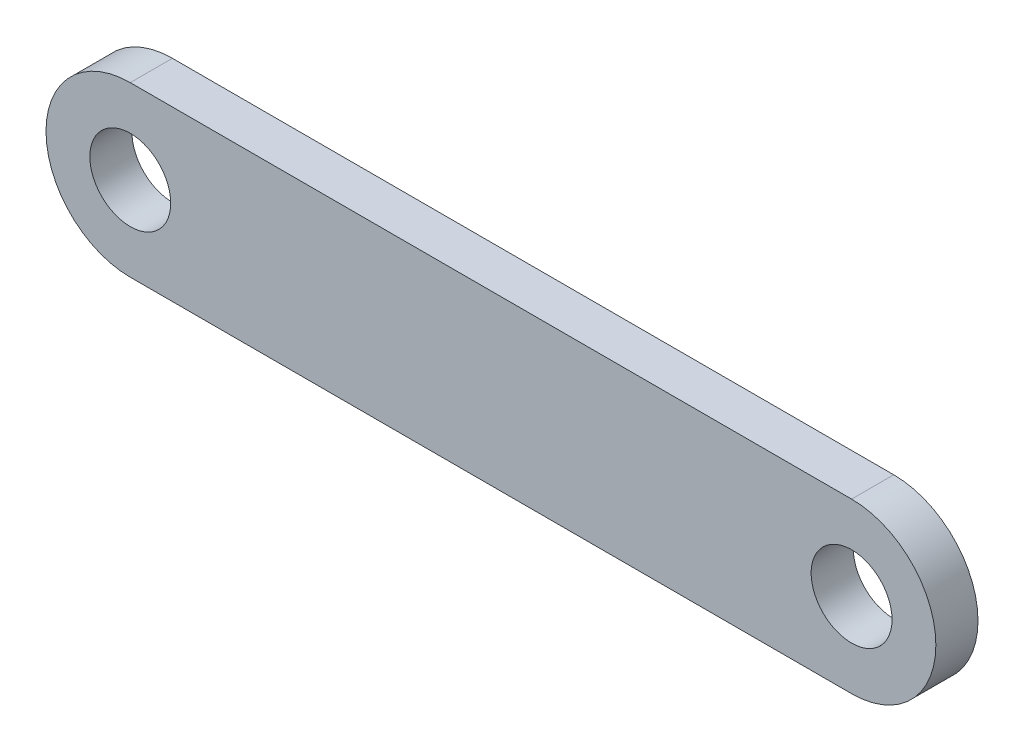
ISO-10303-21;
HEADER;
FILE_DESCRIPTION(('STEP AP214'),'2;1');
FILE_NAME('part.step','',(''),(''),'','','');
FILE_SCHEMA(('AUTOMOTIVE_DESIGN { 1 0 10303 214 1 1 1 1 }'));
ENDSEC;
DATA;
#1=APPLICATION_CONTEXT('core data for automotive mechanical design processes');
#2=APPLICATION_PROTOCOL_DEFINITION('international standard','automotive_design',2000,#1);
#3=PRODUCT_CONTEXT('',#1,'mechanical');
#4=PRODUCT('Part','Part','',(#3));
#5=PRODUCT_RELATED_PRODUCT_CATEGORY('part','',(#4));
#6=PRODUCT_DEFINITION_FORMATION('','',#4);
#7=PRODUCT_DEFINITION_CONTEXT('part definition',#1,'design');
#8=PRODUCT_DEFINITION('design','',#6,#7);
#9=PRODUCT_DEFINITION_SHAPE('','',#8);
#10=(LENGTH_UNIT() NAMED_UNIT(*) SI_UNIT(.MILLI.,.METRE.));
#11=(NAMED_UNIT(*) PLANE_ANGLE_UNIT() SI_UNIT($,.RADIAN.));
#12=(NAMED_UNIT(*) SI_UNIT($,.STERADIAN.) SOLID_ANGLE_UNIT());
#13=UNCERTAINTY_MEASURE_WITH_UNIT(LENGTH_MEASURE(1.E-05),#10,'distance_accuracy_value','');
#14=(GEOMETRIC_REPRESENTATION_CONTEXT(3) GLOBAL_UNCERTAINTY_ASSIGNED_CONTEXT((#13)) GLOBAL_UNIT_ASSIGNED_CONTEXT((#10,
#11,#12)) REPRESENTATION_CONTEXT('',''));
#15=CARTESIAN_POINT('',(0.,0.,0.));
#16=DIRECTION('',(0.,0.,1.));
#17=DIRECTION('',(1.,0.,0.));
#18=AXIS2_PLACEMENT_3D('',#15,#16,#17);
#19=CARTESIAN_POINT('',(27.178,0.,3.175));
#20=DIRECTION('',(0.,0.,1.));
#21=DIRECTION('',(1.,0.,0.));
#22=AXIS2_PLACEMENT_3D('',#19,#20,#21);
#23=PLANE('',#22);
#24=CARTESIAN_POINT('',(27.178,0.,3.175));
#25=DIRECTION('',(0.,0.,1.));
#26=DIRECTION('',(1.,0.,0.));
#27=AXIS2_PLACEMENT_3D('',#24,#25,#26);
#28=CIRCLE('',#27,3.048);
#29=CARTESIAN_POINT('',(30.226,0.,3.175));
#30=VERTEX_POINT('',#29);
#31=EDGE_CURVE('E112',#30,#30,#28,.T.);
#32=ORIENTED_EDGE('',*,*,#31,.F.);
#33=EDGE_LOOP('',(#32));
#34=FACE_BOUND('',#33,.T.);
#35=CARTESIAN_POINT('',(27.178,0.,3.175));
#36=DIRECTION('',(0.,0.,1.));
#37=DIRECTION('',(1.,0.,0.));
#38=AXIS2_PLACEMENT_3D('',#35,#36,#37);
#39=CIRCLE('',#38,6.35);
#40=CARTESIAN_POINT('',(27.178,-6.35,3.175));
#41=VERTEX_POINT('',#40);
#42=CARTESIAN_POINT('',(27.178,6.35,3.175));
#43=VERTEX_POINT('',#42);
#44=EDGE_CURVE('E92',#41,#43,#39,.T.);
#45=ORIENTED_EDGE('',*,*,#44,.T.);
#46=DIRECTION('',(-1.,0.,0.));
#47=VECTOR('',#46,1.);
#48=CARTESIAN_POINT('',(-27.178,6.35,3.175));
#49=LINE('',#48,#47);
#50=CARTESIAN_POINT('',(-27.178,6.35,3.175));
#51=VERTEX_POINT('',#50);
#52=EDGE_CURVE('E87',#43,#51,#49,.T.);
#53=ORIENTED_EDGE('',*,*,#52,.T.);
#54=CARTESIAN_POINT('',(-27.178,0.,3.175));
#55=DIRECTION('',(0.,0.,1.));
#56=DIRECTION('',(1.,0.,0.));
#57=AXIS2_PLACEMENT_3D('',#54,#55,#56);
#58=CIRCLE('',#57,6.35);
#59=CARTESIAN_POINT('',(-27.178,-6.35,3.175));
#60=VERTEX_POINT('',#59);
#61=EDGE_CURVE('E90',#51,#60,#58,.T.);
#62=ORIENTED_EDGE('',*,*,#61,.T.);
#63=DIRECTION('',(1.,0.,0.));
#64=VECTOR('',#63,1.);
#65=CARTESIAN_POINT('',(-27.178,-6.35,3.175));
#66=LINE('',#65,#64);
#67=EDGE_CURVE('E57',#60,#41,#66,.T.);
#68=ORIENTED_EDGE('',*,*,#67,.T.);
#69=EDGE_LOOP('',(#45,#53,#62,#68));
#70=FACE_BOUND('',#69,.T.);
#71=CARTESIAN_POINT('',(-27.178,0.,3.175));
#72=DIRECTION('',(0.,0.,1.));
#73=DIRECTION('',(1.,0.,0.));
#74=AXIS2_PLACEMENT_3D('',#71,#72,#73);
#75=CIRCLE('',#74,3.048);
#76=CARTESIAN_POINT('',(-24.13,0.,3.175));
#77=VERTEX_POINT('',#76);
#78=EDGE_CURVE('E134',#77,#77,#75,.T.);
#79=ORIENTED_EDGE('',*,*,#78,.F.);
#80=EDGE_LOOP('',(#79));
#81=FACE_BOUND('',#80,.T.);
#82=ADVANCED_FACE('F39',(#34,#70,#81),#23,.T.);
#83=CARTESIAN_POINT('',(27.178,0.,0.));
#84=DIRECTION('',(0.,0.,1.));
#85=DIRECTION('',(1.,0.,0.));
#86=AXIS2_PLACEMENT_3D('',#83,#84,#85);
#87=PLANE('',#86);
#88=CARTESIAN_POINT('',(27.178,0.,0.));
#89=DIRECTION('',(0.,0.,1.));
#90=DIRECTION('',(1.,0.,0.));
#91=AXIS2_PLACEMENT_3D('',#88,#89,#90);
#92=CIRCLE('',#91,6.35);
#93=CARTESIAN_POINT('',(27.178,-6.35,0.));
#94=VERTEX_POINT('',#93);
#95=CARTESIAN_POINT('',(27.178,6.35,0.));
#96=VERTEX_POINT('',#95);
#97=EDGE_CURVE('E108',#94,#96,#92,.T.);
#98=ORIENTED_EDGE('',*,*,#97,.F.);
#99=DIRECTION('',(1.,0.,0.));
#100=VECTOR('',#99,1.);
#101=CARTESIAN_POINT('',(-27.178,-6.35,0.));
#102=LINE('',#101,#100);
#103=CARTESIAN_POINT('',(-27.178,-6.35,0.));
#104=VERTEX_POINT('',#103);
#105=EDGE_CURVE('E80',#104,#94,#102,.T.);
#106=ORIENTED_EDGE('',*,*,#105,.F.);
#107=CARTESIAN_POINT('',(-27.178,0.,0.));
#108=DIRECTION('',(0.,0.,1.));
#109=DIRECTION('',(1.,0.,0.));
#110=AXIS2_PLACEMENT_3D('',#107,#108,#109);
#111=CIRCLE('',#110,6.35);
#112=CARTESIAN_POINT('',(-27.178,6.35,0.));
#113=VERTEX_POINT('',#112);
#114=EDGE_CURVE('E74',#113,#104,#111,.T.);
#115=ORIENTED_EDGE('',*,*,#114,.F.);
#116=DIRECTION('',(-1.,0.,0.));
#117=VECTOR('',#116,1.);
#118=CARTESIAN_POINT('',(-27.178,6.35,0.));
#119=LINE('',#118,#117);
#120=EDGE_CURVE('E97',#96,#113,#119,.T.);
#121=ORIENTED_EDGE('',*,*,#120,.F.);
#122=EDGE_LOOP('',(#98,#106,#115,#121));
#123=FACE_BOUND('',#122,.T.);
#124=CARTESIAN_POINT('',(27.178,0.,0.));
#125=DIRECTION('',(0.,0.,1.));
#126=DIRECTION('',(1.,0.,0.));
#127=AXIS2_PLACEMENT_3D('',#124,#125,#126);
#128=CIRCLE('',#127,3.048);
#129=CARTESIAN_POINT('',(30.226,0.,0.));
#130=VERTEX_POINT('',#129);
#131=EDGE_CURVE('E130',#130,#130,#128,.T.);
#132=ORIENTED_EDGE('',*,*,#131,.T.);
#133=EDGE_LOOP('',(#132));
#134=FACE_BOUND('',#133,.T.);
#135=CARTESIAN_POINT('',(-27.178,0.,0.));
#136=DIRECTION('',(0.,0.,1.));
#137=DIRECTION('',(1.,0.,0.));
#138=AXIS2_PLACEMENT_3D('',#135,#136,#137);
#139=CIRCLE('',#138,3.048);
#140=CARTESIAN_POINT('',(-24.13,0.,0.));
#141=VERTEX_POINT('',#140);
#142=EDGE_CURVE('E138',#141,#141,#139,.T.);
#143=ORIENTED_EDGE('',*,*,#142,.T.);
#144=EDGE_LOOP('',(#143));
#145=FACE_BOUND('',#144,.T.);
#146=ADVANCED_FACE('F125',(#123,#134,#145),#87,.F.);
#147=CARTESIAN_POINT('',(27.178,0.,3.175));
#148=DIRECTION('',(0.,0.,-1.));
#149=DIRECTION('',(-1.,0.,0.));
#150=AXIS2_PLACEMENT_3D('',#147,#148,#149);
#151=CYLINDRICAL_SURFACE('',#150,6.35);
#152=ORIENTED_EDGE('',*,*,#97,.T.);
#153=DIRECTION('',(0.,0.,-1.));
#154=VECTOR('',#153,1.);
#155=CARTESIAN_POINT('',(27.178,6.35,3.175));
#156=LINE('',#155,#154);
#157=EDGE_CURVE('E11',#43,#96,#156,.T.);
#158=ORIENTED_EDGE('',*,*,#157,.F.);
#159=ORIENTED_EDGE('',*,*,#44,.F.);
#160=DIRECTION('',(0.,0.,-1.));
#161=VECTOR('',#160,1.);
#162=CARTESIAN_POINT('',(27.178,-6.35,3.175));
#163=LINE('',#162,#161);
#164=EDGE_CURVE('E104',#41,#94,#163,.T.);
#165=ORIENTED_EDGE('',*,*,#164,.T.);
#166=EDGE_LOOP('',(#152,#158,#159,#165));
#167=FACE_BOUND('',#166,.T.);
#168=ADVANCED_FACE('F41',(#167),#151,.T.);
#169=CARTESIAN_POINT('',(-27.178,6.35,3.175));
#170=DIRECTION('',(0.,-1.,0.));
#171=DIRECTION('',(0.,0.,-1.));
#172=AXIS2_PLACEMENT_3D('',#169,#170,#171);
#173=PLANE('',#172);
#174=ORIENTED_EDGE('',*,*,#120,.T.);
#175=DIRECTION('',(0.,0.,-1.));
#176=VECTOR('',#175,1.);
#177=CARTESIAN_POINT('',(-27.178,6.35,3.175));
#178=LINE('',#177,#176);
#179=EDGE_CURVE('E49',#51,#113,#178,.T.);
#180=ORIENTED_EDGE('',*,*,#179,.F.);
#181=ORIENTED_EDGE('',*,*,#52,.F.);
#182=ORIENTED_EDGE('',*,*,#157,.T.);
#183=EDGE_LOOP('',(#174,#180,#181,#182));
#184=FACE_BOUND('',#183,.T.);
#185=ADVANCED_FACE('F96',(#184),#173,.F.);
#186=CARTESIAN_POINT('',(-27.178,0.,3.175));
#187=DIRECTION('',(0.,0.,-1.));
#188=DIRECTION('',(-1.,0.,0.));
#189=AXIS2_PLACEMENT_3D('',#186,#187,#188);
#190=CYLINDRICAL_SURFACE('',#189,6.35);
#191=ORIENTED_EDGE('',*,*,#114,.T.);
#192=DIRECTION('',(0.,0.,-1.));
#193=VECTOR('',#192,1.);
#194=CARTESIAN_POINT('',(-27.178,-6.35,3.175));
#195=LINE('',#194,#193);
#196=EDGE_CURVE('E99',#60,#104,#195,.T.);
#197=ORIENTED_EDGE('',*,*,#196,.F.);
#198=ORIENTED_EDGE('',*,*,#61,.F.);
#199=ORIENTED_EDGE('',*,*,#179,.T.);
#200=EDGE_LOOP('',(#191,#197,#198,#199));
#201=FACE_BOUND('',#200,.T.);
#202=ADVANCED_FACE('F100',(#201),#190,.T.);
#203=CARTESIAN_POINT('',(-27.178,-6.35,3.175));
#204=DIRECTION('',(0.,1.,0.));
#205=DIRECTION('',(0.,0.,1.));
#206=AXIS2_PLACEMENT_3D('',#203,#204,#205);
#207=PLANE('',#206);
#208=ORIENTED_EDGE('',*,*,#105,.T.);
#209=ORIENTED_EDGE('',*,*,#164,.F.);
#210=ORIENTED_EDGE('',*,*,#67,.F.);
#211=ORIENTED_EDGE('',*,*,#196,.T.);
#212=EDGE_LOOP('',(#208,#209,#210,#211));
#213=FACE_BOUND('',#212,.T.);
#214=ADVANCED_FACE('F122',(#213),#207,.F.);
#215=CARTESIAN_POINT('',(27.178,0.,3.175));
#216=DIRECTION('',(0.,0.,-1.));
#217=DIRECTION('',(-1.,0.,0.));
#218=AXIS2_PLACEMENT_3D('',#215,#216,#217);
#219=CYLINDRICAL_SURFACE('',#218,3.048);
#220=ORIENTED_EDGE('',*,*,#31,.T.);
#221=EDGE_LOOP('',(#220));
#222=FACE_BOUND('',#221,.T.);
#223=ORIENTED_EDGE('',*,*,#131,.F.);
#224=EDGE_LOOP('',(#223));
#225=FACE_BOUND('',#224,.T.);
#226=ADVANCED_FACE('F157',(#222,#225),#219,.F.);
#227=CARTESIAN_POINT('',(-27.178,0.,3.175));
#228=DIRECTION('',(0.,0.,-1.));
#229=DIRECTION('',(-1.,0.,0.));
#230=AXIS2_PLACEMENT_3D('',#227,#228,#229);
#231=CYLINDRICAL_SURFACE('',#230,3.048);
#232=ORIENTED_EDGE('',*,*,#78,.T.);
#233=EDGE_LOOP('',(#232));
#234=FACE_BOUND('',#233,.T.);
#235=ORIENTED_EDGE('',*,*,#142,.F.);
#236=EDGE_LOOP('',(#235));
#237=FACE_BOUND('',#236,.T.);
#238=ADVANCED_FACE('F146',(#234,#237),#231,.F.);
#239=CLOSED_SHELL('',(#82,#146,#168,#185,#202,#214,#226,#238));
#240=MANIFOLD_SOLID_BREP('B2',#239);
#241=ADVANCED_BREP_SHAPE_REPRESENTATION('',(#18,#240),#14);
#242=SHAPE_DEFINITION_REPRESENTATION(#9,#241);
ENDSEC;
END-ISO-10303-21;
